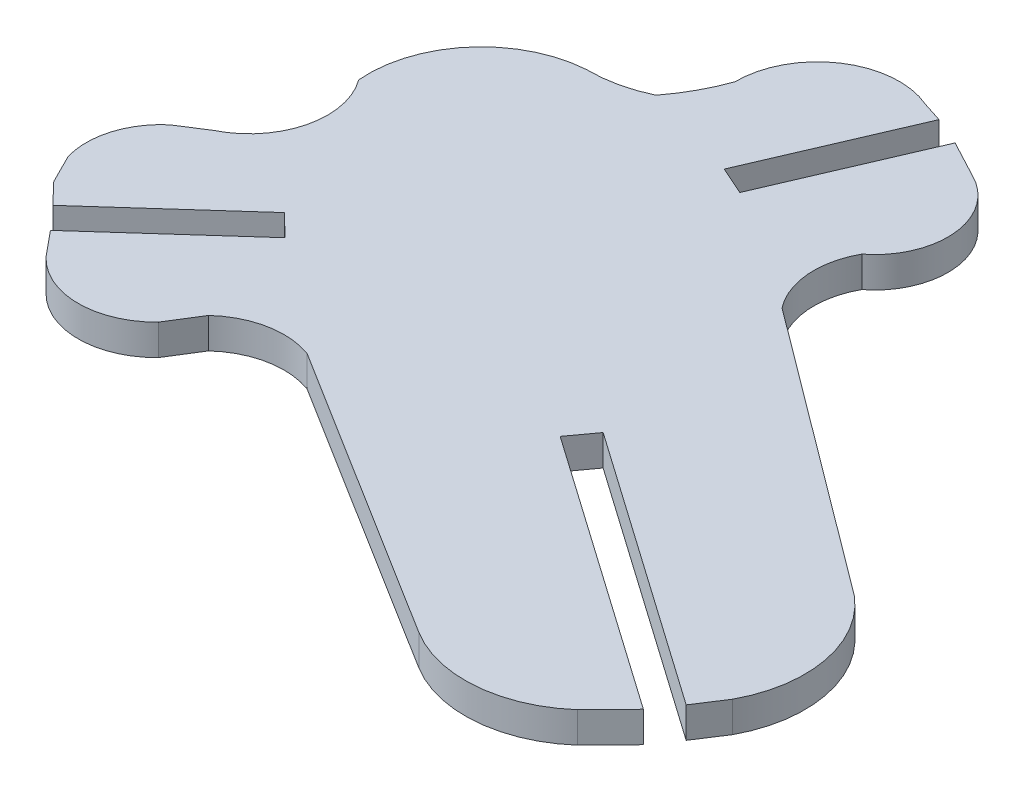
ISO-10303-21;
HEADER;
FILE_DESCRIPTION(('STEP AP214'),'2;1');
FILE_NAME('part.step','',(''),(''),'','','');
FILE_SCHEMA(('AUTOMOTIVE_DESIGN { 1 0 10303 214 1 1 1 1 }'));
ENDSEC;
DATA;
#1=APPLICATION_CONTEXT('core data for automotive mechanical design processes');
#2=APPLICATION_PROTOCOL_DEFINITION('international standard','automotive_design',2000,#1);
#3=PRODUCT_CONTEXT('',#1,'mechanical');
#4=PRODUCT('Part','Part','',(#3));
#5=PRODUCT_RELATED_PRODUCT_CATEGORY('part','',(#4));
#6=PRODUCT_DEFINITION_FORMATION('','',#4);
#7=PRODUCT_DEFINITION_CONTEXT('part definition',#1,'design');
#8=PRODUCT_DEFINITION('design','',#6,#7);
#9=PRODUCT_DEFINITION_SHAPE('','',#8);
#10=(LENGTH_UNIT() NAMED_UNIT(*) SI_UNIT(.MILLI.,.METRE.));
#11=(NAMED_UNIT(*) PLANE_ANGLE_UNIT() SI_UNIT($,.RADIAN.));
#12=(NAMED_UNIT(*) SI_UNIT($,.STERADIAN.) SOLID_ANGLE_UNIT());
#13=UNCERTAINTY_MEASURE_WITH_UNIT(LENGTH_MEASURE(1.E-05),#10,'distance_accuracy_value','');
#14=(GEOMETRIC_REPRESENTATION_CONTEXT(3) GLOBAL_UNCERTAINTY_ASSIGNED_CONTEXT((#13)) GLOBAL_UNIT_ASSIGNED_CONTEXT((#10,
#11,#12)) REPRESENTATION_CONTEXT('',''));
#15=CARTESIAN_POINT('',(0.,0.,0.));
#16=DIRECTION('',(0.,0.,1.));
#17=DIRECTION('',(1.,0.,0.));
#18=AXIS2_PLACEMENT_3D('',#15,#16,#17);
#19=CARTESIAN_POINT('',(-378.561300394113,2.,-476.52606898203));
#20=DIRECTION('',(-0.838786714596922,0.,-0.544460143091945));
#21=DIRECTION('',(-0.544460143091945,0.,0.838786714596922));
#22=AXIS2_PLACEMENT_3D('',#19,#20,#21);
#23=PLANE('',#22);
#24=DIRECTION('',(0.544460143091945,0.,-0.838786714596922));
#25=VECTOR('',#24,1.);
#26=CARTESIAN_POINT('',(-378.561300394113,0.,-476.52606898203));
#27=LINE('',#26,#25);
#28=CARTESIAN_POINT('',(-283.586609999994,0.,-622.842579999972));
#29=VERTEX_POINT('',#28);
#30=CARTESIAN_POINT('',(-282.399079999994,0.,-624.672069999972));
#31=VERTEX_POINT('',#30);
#32=EDGE_CURVE('E11',#29,#31,#27,.T.);
#33=ORIENTED_EDGE('',*,*,#32,.T.);
#34=DIRECTION('',(0.,-1.,0.));
#35=VECTOR('',#34,1.);
#36=CARTESIAN_POINT('',(-282.399079999994,2.,-624.672069999972));
#37=LINE('',#36,#35);
#38=CARTESIAN_POINT('',(-282.399079999994,2.,-624.672069999972));
#39=VERTEX_POINT('',#38);
#40=EDGE_CURVE('E612',#39,#31,#37,.T.);
#41=ORIENTED_EDGE('',*,*,#40,.F.);
#42=DIRECTION('',(0.544460143091945,0.,-0.838786714596922));
#43=VECTOR('',#42,1.);
#44=CARTESIAN_POINT('',(-378.561300394113,2.,-476.52606898203));
#45=LINE('',#44,#43);
#46=CARTESIAN_POINT('',(-283.586609999994,2.,-622.842579999972));
#47=VERTEX_POINT('',#46);
#48=EDGE_CURVE('E41',#47,#39,#45,.T.);
#49=ORIENTED_EDGE('',*,*,#48,.F.);
#50=DIRECTION('',(0.,-1.,0.));
#51=VECTOR('',#50,1.);
#52=CARTESIAN_POINT('',(-283.586609999994,2.,-622.842579999972));
#53=LINE('',#52,#51);
#54=EDGE_CURVE('E285',#47,#29,#53,.T.);
#55=ORIENTED_EDGE('',*,*,#54,.T.);
#56=EDGE_LOOP('',(#33,#41,#49,#55));
#57=FACE_BOUND('',#56,.T.);
#58=ADVANCED_FACE('F37',(#57),#23,.F.);
#59=CARTESIAN_POINT('',(-289.332270328096,2.,-628.422141711353));
#60=DIRECTION('',(0.,-1.,0.));
#61=DIRECTION('',(0.,0.,-1.));
#62=AXIS2_PLACEMENT_3D('',#59,#60,#61);
#63=CYLINDRICAL_SURFACE('',#62,7.88239595340002);
#64=CARTESIAN_POINT('',(-289.332270328096,0.,-628.422141711353));
#65=DIRECTION('',(0.,1.,0.));
#66=DIRECTION('',(0.,0.,1.));
#67=AXIS2_PLACEMENT_3D('',#64,#65,#66);
#68=CIRCLE('',#67,7.88239595340002);
#69=CARTESIAN_POINT('',(-284.277699999916,0.,-634.470570000062));
#70=VERTEX_POINT('',#69);
#71=EDGE_CURVE('E47',#31,#70,#68,.T.);
#72=ORIENTED_EDGE('',*,*,#71,.T.);
#73=DIRECTION('',(0.,-1.,0.));
#74=VECTOR('',#73,1.);
#75=CARTESIAN_POINT('',(-284.277699999916,2.,-634.470570000062));
#76=LINE('',#75,#74);
#77=CARTESIAN_POINT('',(-284.277699999916,2.,-634.470570000062));
#78=VERTEX_POINT('',#77);
#79=EDGE_CURVE('E266',#78,#70,#76,.T.);
#80=ORIENTED_EDGE('',*,*,#79,.F.);
#81=CARTESIAN_POINT('',(-289.332270328096,2.,-628.422141711353));
#82=DIRECTION('',(0.,1.,0.));
#83=DIRECTION('',(0.,0.,1.));
#84=AXIS2_PLACEMENT_3D('',#81,#82,#83);
#85=CIRCLE('',#84,7.88239595340002);
#86=EDGE_CURVE('E155',#39,#78,#85,.T.);
#87=ORIENTED_EDGE('',*,*,#86,.F.);
#88=ORIENTED_EDGE('',*,*,#40,.T.);
#89=EDGE_LOOP('',(#72,#80,#87,#88));
#90=FACE_BOUND('',#89,.T.);
#91=ADVANCED_FACE('F613',(#90),#63,.T.);
#92=CARTESIAN_POINT('',(-409.518925743957,2.,-727.979335949588));
#93=DIRECTION('',(-0.598269996905994,0.,0.801294584283522));
#94=DIRECTION('',(0.801294584283522,0.,0.598269996905994));
#95=AXIS2_PLACEMENT_3D('',#92,#93,#94);
#96=PLANE('',#95);
#97=DIRECTION('',(-0.801294584283522,0.,-0.598269996905994));
#98=VECTOR('',#97,1.);
#99=CARTESIAN_POINT('',(-409.518925743957,0.,-727.979335949588));
#100=LINE('',#99,#98);
#101=CARTESIAN_POINT('',(-302.832329999945,0.,-648.32400000001));
#102=VERTEX_POINT('',#101);
#103=EDGE_CURVE('E269',#70,#102,#100,.T.);
#104=ORIENTED_EDGE('',*,*,#103,.T.);
#105=DIRECTION('',(0.,-1.,0.));
#106=VECTOR('',#105,1.);
#107=CARTESIAN_POINT('',(-302.832329999945,2.,-648.32400000001));
#108=LINE('',#107,#106);
#109=CARTESIAN_POINT('',(-302.832329999945,2.,-648.32400000001));
#110=VERTEX_POINT('',#109);
#111=EDGE_CURVE('E256',#110,#102,#108,.T.);
#112=ORIENTED_EDGE('',*,*,#111,.F.);
#113=DIRECTION('',(-0.801294584283522,0.,-0.598269996905994));
#114=VECTOR('',#113,1.);
#115=CARTESIAN_POINT('',(-409.518925743957,2.,-727.979335949588));
#116=LINE('',#115,#114);
#117=EDGE_CURVE('E344',#78,#110,#116,.T.);
#118=ORIENTED_EDGE('',*,*,#117,.F.);
#119=ORIENTED_EDGE('',*,*,#79,.T.);
#120=EDGE_LOOP('',(#104,#112,#118,#119));
#121=FACE_BOUND('',#120,.T.);
#122=ADVANCED_FACE('F270',(#121),#96,.F.);
#123=CARTESIAN_POINT('',(-298.786970211467,2.,-651.471792718293));
#124=DIRECTION('',(0.,-1.,0.));
#125=DIRECTION('',(0.,0.,-1.));
#126=AXIS2_PLACEMENT_3D('',#123,#124,#125);
#127=CYLINDRICAL_SURFACE('',#126,5.12577163122829);
#128=CARTESIAN_POINT('',(-298.786970211467,0.,-651.471792718293));
#129=DIRECTION('',(0.,1.,0.));
#130=DIRECTION('',(0.,0.,1.));
#131=AXIS2_PLACEMENT_3D('',#128,#129,#130);
#132=CIRCLE('',#131,5.12577163122829);
#133=CARTESIAN_POINT('',(-303.270539999969,0.,-653.955970000039));
#134=VERTEX_POINT('',#133);
#135=EDGE_CURVE('E260',#134,#102,#132,.T.);
#136=ORIENTED_EDGE('',*,*,#135,.F.);
#137=DIRECTION('',(0.,-1.,0.));
#138=VECTOR('',#137,1.);
#139=CARTESIAN_POINT('',(-303.270539999969,2.,-653.955970000039));
#140=LINE('',#139,#138);
#141=CARTESIAN_POINT('',(-303.270539999969,2.,-653.955970000039));
#142=VERTEX_POINT('',#141);
#143=EDGE_CURVE('E265',#142,#134,#140,.T.);
#144=ORIENTED_EDGE('',*,*,#143,.F.);
#145=CARTESIAN_POINT('',(-298.786970211467,2.,-651.471792718293));
#146=DIRECTION('',(0.,1.,0.));
#147=DIRECTION('',(0.,0.,1.));
#148=AXIS2_PLACEMENT_3D('',#145,#146,#147);
#149=CIRCLE('',#148,5.12577163122829);
#150=EDGE_CURVE('E262',#142,#110,#149,.T.);
#151=ORIENTED_EDGE('',*,*,#150,.T.);
#152=ORIENTED_EDGE('',*,*,#111,.T.);
#153=EDGE_LOOP('',(#136,#144,#151,#152));
#154=FACE_BOUND('',#153,.T.);
#155=ADVANCED_FACE('F258',(#154),#127,.F.);
#156=CARTESIAN_POINT('',(-306.168269640505,2.,-657.708026461513));
#157=DIRECTION('',(0.,-1.,0.));
#158=DIRECTION('',(0.,0.,-1.));
#159=AXIS2_PLACEMENT_3D('',#156,#157,#158);
#160=CYLINDRICAL_SURFACE('',#159,4.7407557161);
#161=CARTESIAN_POINT('',(-306.168269640505,0.,-657.708026461513));
#162=DIRECTION('',(0.,1.,0.));
#163=DIRECTION('',(0.,0.,1.));
#164=AXIS2_PLACEMENT_3D('',#161,#162,#163);
#165=CIRCLE('',#164,4.7407557161);
#166=CARTESIAN_POINT('',(-304.08436999999,0.,-661.966210000065));
#167=VERTEX_POINT('',#166);
#168=EDGE_CURVE('E275',#134,#167,#165,.T.);
#169=ORIENTED_EDGE('',*,*,#168,.T.);
#170=DIRECTION('',(0.,-1.,0.));
#171=VECTOR('',#170,1.);
#172=CARTESIAN_POINT('',(-304.08436999999,2.,-661.966210000065));
#173=LINE('',#172,#171);
#174=CARTESIAN_POINT('',(-304.08436999999,2.,-661.966210000065));
#175=VERTEX_POINT('',#174);
#176=EDGE_CURVE('E416',#175,#167,#173,.T.);
#177=ORIENTED_EDGE('',*,*,#176,.F.);
#178=CARTESIAN_POINT('',(-306.168269640505,2.,-657.708026461513));
#179=DIRECTION('',(0.,1.,0.));
#180=DIRECTION('',(0.,0.,1.));
#181=AXIS2_PLACEMENT_3D('',#178,#179,#180);
#182=CIRCLE('',#181,4.7407557161);
#183=EDGE_CURVE('E341',#142,#175,#182,.T.);
#184=ORIENTED_EDGE('',*,*,#183,.F.);
#185=ORIENTED_EDGE('',*,*,#143,.T.);
#186=EDGE_LOOP('',(#169,#177,#184,#185));
#187=FACE_BOUND('',#186,.T.);
#188=ADVANCED_FACE('F607',(#187),#160,.T.);
#189=CARTESIAN_POINT('',(-439.594122259617,2.,-734.137268923904));
#190=DIRECTION('',(-0.470076957730303,0.,0.882625432338669));
#191=DIRECTION('',(0.882625432338669,0.,0.470076957730303));
#192=AXIS2_PLACEMENT_3D('',#189,#190,#191);
#193=PLANE('',#192);
#194=DIRECTION('',(-0.882625432338669,0.,-0.470076957730303));
#195=VECTOR('',#194,1.);
#196=CARTESIAN_POINT('',(-439.594122259617,0.,-734.137268923904));
#197=LINE('',#196,#195);
#198=CARTESIAN_POINT('',(-306.502179999992,0.,-663.253910000007));
#199=VERTEX_POINT('',#198);
#200=EDGE_CURVE('E277',#167,#199,#197,.T.);
#201=ORIENTED_EDGE('',*,*,#200,.T.);
#202=DIRECTION('',(0.,-1.,0.));
#203=VECTOR('',#202,1.);
#204=CARTESIAN_POINT('',(-306.502179999992,2.,-663.253910000007));
#205=LINE('',#204,#203);
#206=CARTESIAN_POINT('',(-306.502179999992,2.,-663.253910000007));
#207=VERTEX_POINT('',#206);
#208=EDGE_CURVE('E413',#207,#199,#205,.T.);
#209=ORIENTED_EDGE('',*,*,#208,.F.);
#210=DIRECTION('',(-0.882625432338669,0.,-0.470076957730303));
#211=VECTOR('',#210,1.);
#212=CARTESIAN_POINT('',(-439.594122259617,2.,-734.137268923904));
#213=LINE('',#212,#211);
#214=EDGE_CURVE('E339',#175,#207,#213,.T.);
#215=ORIENTED_EDGE('',*,*,#214,.F.);
#216=ORIENTED_EDGE('',*,*,#176,.T.);
#217=EDGE_LOOP('',(#201,#209,#215,#216));
#218=FACE_BOUND('',#217,.T.);
#219=ADVANCED_FACE('F411',(#218),#193,.F.);
#220=CARTESIAN_POINT('',(-373.713233914578,2.,-506.785670706769));
#221=DIRECTION('',(0.918818909782736,0.,0.394679377502377));
#222=DIRECTION('',(0.394679377502377,0.,-0.918818909782736));
#223=AXIS2_PLACEMENT_3D('',#220,#221,#222);
#224=PLANE('',#223);
#225=DIRECTION('',(-0.394679377502377,0.,0.918818909782736));
#226=VECTOR('',#225,1.);
#227=CARTESIAN_POINT('',(-373.713233914578,0.,-506.785670706769));
#228=LINE('',#227,#226);
#229=CARTESIAN_POINT('',(-310.710939999992,0.,-653.455860000007));
#230=VERTEX_POINT('',#229);
#231=EDGE_CURVE('E406',#199,#230,#228,.T.);
#232=ORIENTED_EDGE('',*,*,#231,.T.);
#233=DIRECTION('',(0.,-1.,0.));
#234=VECTOR('',#233,1.);
#235=CARTESIAN_POINT('',(-310.710939999992,2.,-653.455860000007));
#236=LINE('',#235,#234);
#237=CARTESIAN_POINT('',(-310.710939999992,2.,-653.455860000007));
#238=VERTEX_POINT('',#237);
#239=EDGE_CURVE('E422',#238,#230,#236,.T.);
#240=ORIENTED_EDGE('',*,*,#239,.F.);
#241=DIRECTION('',(-0.394679377502377,0.,0.918818909782736));
#242=VECTOR('',#241,1.);
#243=CARTESIAN_POINT('',(-373.713233914578,2.,-506.785670706769));
#244=LINE('',#243,#242);
#245=EDGE_CURVE('E337',#207,#238,#244,.T.);
#246=ORIENTED_EDGE('',*,*,#245,.F.);
#247=ORIENTED_EDGE('',*,*,#208,.T.);
#248=EDGE_LOOP('',(#232,#240,#246,#247));
#249=FACE_BOUND('',#248,.T.);
#250=ADVANCED_FACE('F419',(#249),#224,.F.);
#251=CARTESIAN_POINT('',(-460.12903676952,2.,-719.925042014085));
#252=DIRECTION('',(-0.40645063244985,0.,0.913672744138248));
#253=DIRECTION('',(0.913672744138248,0.,0.40645063244985));
#254=AXIS2_PLACEMENT_3D('',#251,#252,#253);
#255=PLANE('',#254);
#256=DIRECTION('',(-0.913672744138248,0.,-0.40645063244985));
#257=VECTOR('',#256,1.);
#258=CARTESIAN_POINT('',(-460.12903676952,0.,-719.925042014085));
#259=LINE('',#258,#257);
#260=CARTESIAN_POINT('',(-312.538439999992,0.,-654.268830000007));
#261=VERTEX_POINT('',#260);
#262=EDGE_CURVE('E404',#230,#261,#259,.T.);
#263=ORIENTED_EDGE('',*,*,#262,.T.);
#264=DIRECTION('',(0.,-1.,0.));
#265=VECTOR('',#264,1.);
#266=CARTESIAN_POINT('',(-312.538439999992,2.,-654.268830000007));
#267=LINE('',#266,#265);
#268=CARTESIAN_POINT('',(-312.538439999992,2.,-654.268830000007));
#269=VERTEX_POINT('',#268);
#270=EDGE_CURVE('E432',#269,#261,#267,.T.);
#271=ORIENTED_EDGE('',*,*,#270,.F.);
#272=DIRECTION('',(-0.913672744138248,0.,-0.40645063244985));
#273=VECTOR('',#272,1.);
#274=CARTESIAN_POINT('',(-460.12903676952,2.,-719.925042014085));
#275=LINE('',#274,#273);
#276=EDGE_CURVE('E335',#238,#269,#275,.T.);
#277=ORIENTED_EDGE('',*,*,#276,.F.);
#278=ORIENTED_EDGE('',*,*,#239,.T.);
#279=EDGE_LOOP('',(#263,#271,#277,#278));
#280=FACE_BOUND('',#279,.T.);
#281=ADVANCED_FACE('F430',(#280),#255,.F.);
#282=CARTESIAN_POINT('',(-375.550906364474,2.,-507.57501828767));
#283=DIRECTION('',(-0.918818852040724,0.,-0.394679511926534));
#284=DIRECTION('',(-0.394679511926534,0.,0.918818852040724));
#285=AXIS2_PLACEMENT_3D('',#282,#283,#284);
#286=PLANE('',#285);
#287=DIRECTION('',(0.394679511926534,0.,-0.918818852040724));
#288=VECTOR('',#287,1.);
#289=CARTESIAN_POINT('',(-375.550906364474,0.,-507.57501828767));
#290=LINE('',#289,#288);
#291=CARTESIAN_POINT('',(-308.339819999992,0.,-664.043270000007));
#292=VERTEX_POINT('',#291);
#293=EDGE_CURVE('E402',#261,#292,#290,.T.);
#294=ORIENTED_EDGE('',*,*,#293,.T.);
#295=DIRECTION('',(0.,-1.,0.));
#296=VECTOR('',#295,1.);
#297=CARTESIAN_POINT('',(-308.339819999992,2.,-664.043270000007));
#298=LINE('',#297,#296);
#299=CARTESIAN_POINT('',(-308.339819999992,2.,-664.043270000007));
#300=VERTEX_POINT('',#299);
#301=EDGE_CURVE('E438',#300,#292,#298,.T.);
#302=ORIENTED_EDGE('',*,*,#301,.F.);
#303=DIRECTION('',(0.394679511926534,0.,-0.918818852040724));
#304=VECTOR('',#303,1.);
#305=CARTESIAN_POINT('',(-375.550906364474,2.,-507.57501828767));
#306=LINE('',#305,#304);
#307=EDGE_CURVE('E333',#269,#300,#306,.T.);
#308=ORIENTED_EDGE('',*,*,#307,.F.);
#309=ORIENTED_EDGE('',*,*,#270,.T.);
#310=EDGE_LOOP('',(#294,#302,#308,#309));
#311=FACE_BOUND('',#310,.T.);
#312=ADVANCED_FACE('F435',(#311),#286,.F.);
#313=CARTESIAN_POINT('',(-478.407131348155,2.,-719.005644871996));
#314=DIRECTION('',(-0.307519401026566,0.,0.951541810953288));
#315=DIRECTION('',(0.951541810953288,0.,0.307519401026566));
#316=AXIS2_PLACEMENT_3D('',#313,#314,#315);
#317=PLANE('',#316);
#318=DIRECTION('',(-0.951541810953288,0.,-0.307519401026566));
#319=VECTOR('',#318,1.);
#320=CARTESIAN_POINT('',(-478.407131348155,0.,-719.005644871996));
#321=LINE('',#320,#319);
#322=CARTESIAN_POINT('',(-309.657629999992,0.,-664.469160000007));
#323=VERTEX_POINT('',#322);
#324=EDGE_CURVE('E400',#292,#323,#321,.T.);
#325=ORIENTED_EDGE('',*,*,#324,.T.);
#326=DIRECTION('',(0.,-1.,0.));
#327=VECTOR('',#326,1.);
#328=CARTESIAN_POINT('',(-309.657629999992,2.,-664.469160000007));
#329=LINE('',#328,#327);
#330=CARTESIAN_POINT('',(-309.657629999992,2.,-664.469160000007));
#331=VERTEX_POINT('',#330);
#332=EDGE_CURVE('E440',#331,#323,#329,.T.);
#333=ORIENTED_EDGE('',*,*,#332,.F.);
#334=DIRECTION('',(-0.951541810953288,0.,-0.307519401026566));
#335=VECTOR('',#334,1.);
#336=CARTESIAN_POINT('',(-478.407131348155,2.,-719.005644871996));
#337=LINE('',#336,#335);
#338=EDGE_CURVE('E331',#300,#331,#337,.T.);
#339=ORIENTED_EDGE('',*,*,#338,.F.);
#340=ORIENTED_EDGE('',*,*,#301,.T.);
#341=EDGE_LOOP('',(#325,#333,#339,#340));
#342=FACE_BOUND('',#341,.T.);
#343=ADVANCED_FACE('F604',(#342),#317,.F.);
#344=CARTESIAN_POINT('',(-311.779982562592,2.,-659.580154934089));
#345=DIRECTION('',(0.,-1.,0.));
#346=DIRECTION('',(0.,0.,-1.));
#347=AXIS2_PLACEMENT_3D('',#344,#345,#346);
#348=CYLINDRICAL_SURFACE('',#347,5.32979839530001);
#349=CARTESIAN_POINT('',(-311.779982562592,0.,-659.580154934089));
#350=DIRECTION('',(0.,1.,0.));
#351=DIRECTION('',(0.,0.,1.));
#352=AXIS2_PLACEMENT_3D('',#349,#350,#351);
#353=CIRCLE('',#352,5.32979839530001);
#354=CARTESIAN_POINT('',(-317.109500000046,0.,-659.525429999971));
#355=VERTEX_POINT('',#354);
#356=EDGE_CURVE('E397',#323,#355,#353,.T.);
#357=ORIENTED_EDGE('',*,*,#356,.T.);
#358=DIRECTION('',(0.,-1.,0.));
#359=VECTOR('',#358,1.);
#360=CARTESIAN_POINT('',(-317.109500000046,2.,-659.525429999971));
#361=LINE('',#360,#359);
#362=CARTESIAN_POINT('',(-317.109500000046,2.,-659.525429999971));
#363=VERTEX_POINT('',#362);
#364=EDGE_CURVE('E446',#363,#355,#361,.T.);
#365=ORIENTED_EDGE('',*,*,#364,.F.);
#366=CARTESIAN_POINT('',(-311.779982562592,2.,-659.580154934089));
#367=DIRECTION('',(0.,1.,0.));
#368=DIRECTION('',(0.,0.,1.));
#369=AXIS2_PLACEMENT_3D('',#366,#367,#368);
#370=CIRCLE('',#369,5.32979839530001);
#371=EDGE_CURVE('E329',#331,#363,#370,.T.);
#372=ORIENTED_EDGE('',*,*,#371,.F.);
#373=ORIENTED_EDGE('',*,*,#332,.T.);
#374=EDGE_LOOP('',(#357,#365,#372,#373));
#375=FACE_BOUND('',#374,.T.);
#376=ADVANCED_FACE('F599',(#375),#348,.T.);
#377=CARTESIAN_POINT('',(-328.488875009774,2.,-663.600909113507));
#378=DIRECTION('',(0.,-1.,0.));
#379=DIRECTION('',(0.,0.,-1.));
#380=AXIS2_PLACEMENT_3D('',#377,#378,#379);
#381=CYLINDRICAL_SURFACE('',#380,12.087171117217);
#382=CARTESIAN_POINT('',(-328.488875009774,0.,-663.600909113507));
#383=DIRECTION('',(0.,1.,0.));
#384=DIRECTION('',(0.,0.,1.));
#385=AXIS2_PLACEMENT_3D('',#382,#383,#384);
#386=CIRCLE('',#385,12.087171117217);
#387=CARTESIAN_POINT('',(-318.925520000014,0.,-656.208890000018));
#388=VERTEX_POINT('',#387);
#389=EDGE_CURVE('E394',#388,#355,#386,.T.);
#390=ORIENTED_EDGE('',*,*,#389,.F.);
#391=DIRECTION('',(0.,-1.,0.));
#392=VECTOR('',#391,1.);
#393=CARTESIAN_POINT('',(-318.925520000014,2.,-656.208890000018));
#394=LINE('',#393,#392);
#395=CARTESIAN_POINT('',(-318.925520000014,2.,-656.208890000018));
#396=VERTEX_POINT('',#395);
#397=EDGE_CURVE('E448',#396,#388,#394,.T.);
#398=ORIENTED_EDGE('',*,*,#397,.F.);
#399=CARTESIAN_POINT('',(-328.488875009774,2.,-663.600909113507));
#400=DIRECTION('',(0.,1.,0.));
#401=DIRECTION('',(0.,0.,1.));
#402=AXIS2_PLACEMENT_3D('',#399,#400,#401);
#403=CIRCLE('',#402,12.087171117217);
#404=EDGE_CURVE('E326',#396,#363,#403,.T.);
#405=ORIENTED_EDGE('',*,*,#404,.T.);
#406=ORIENTED_EDGE('',*,*,#364,.T.);
#407=EDGE_LOOP('',(#390,#398,#405,#406));
#408=FACE_BOUND('',#407,.T.);
#409=ADVANCED_FACE('F595',(#408),#381,.F.);
#410=CARTESIAN_POINT('',(-322.523782856363,2.,-663.753401573091));
#411=DIRECTION('',(0.,-1.,0.));
#412=DIRECTION('',(0.,0.,-1.));
#413=AXIS2_PLACEMENT_3D('',#410,#411,#412);
#414=CYLINDRICAL_SURFACE('',#413,8.35865721629991);
#415=CARTESIAN_POINT('',(-322.523782856363,0.,-663.753401573091));
#416=DIRECTION('',(0.,1.,0.));
#417=DIRECTION('',(0.,0.,1.));
#418=AXIS2_PLACEMENT_3D('',#415,#416,#417);
#419=CIRCLE('',#418,8.35865721629991);
#420=CARTESIAN_POINT('',(-322.620160000015,0.,-655.395300000019));
#421=VERTEX_POINT('',#420);
#422=EDGE_CURVE('E391',#421,#388,#419,.T.);
#423=ORIENTED_EDGE('',*,*,#422,.F.);
#424=DIRECTION('',(0.,-1.,0.));
#425=VECTOR('',#424,1.);
#426=CARTESIAN_POINT('',(-322.620160000015,2.,-655.395300000019));
#427=LINE('',#426,#425);
#428=CARTESIAN_POINT('',(-322.620160000015,2.,-655.395300000019));
#429=VERTEX_POINT('',#428);
#430=EDGE_CURVE('E450',#429,#421,#427,.T.);
#431=ORIENTED_EDGE('',*,*,#430,.F.);
#432=CARTESIAN_POINT('',(-322.523782856363,2.,-663.753401573091));
#433=DIRECTION('',(0.,1.,0.));
#434=DIRECTION('',(0.,0.,1.));
#435=AXIS2_PLACEMENT_3D('',#432,#433,#434);
#436=CIRCLE('',#435,8.35865721629991);
#437=EDGE_CURVE('E323',#429,#396,#436,.T.);
#438=ORIENTED_EDGE('',*,*,#437,.T.);
#439=ORIENTED_EDGE('',*,*,#397,.T.);
#440=EDGE_LOOP('',(#423,#431,#438,#439));
#441=FACE_BOUND('',#440,.T.);
#442=ADVANCED_FACE('F590',(#441),#414,.F.);
#443=CARTESIAN_POINT('',(-322.127727335265,2.,-648.055033113613));
#444=DIRECTION('',(0.,-1.,0.));
#445=DIRECTION('',(0.,0.,-1.));
#446=AXIS2_PLACEMENT_3D('',#443,#444,#445);
#447=CYLINDRICAL_SURFACE('',#446,7.35676613009999);
#448=CARTESIAN_POINT('',(-322.127727335265,0.,-648.055033113613));
#449=DIRECTION('',(0.,1.,0.));
#450=DIRECTION('',(0.,0.,1.));
#451=AXIS2_PLACEMENT_3D('',#448,#449,#450);
#452=CIRCLE('',#451,7.35676613009999);
#453=CARTESIAN_POINT('',(-329.455989999994,0.,-647.408060000012));
#454=VERTEX_POINT('',#453);
#455=EDGE_CURVE('E388',#421,#454,#452,.T.);
#456=ORIENTED_EDGE('',*,*,#455,.T.);
#457=DIRECTION('',(0.,-1.,0.));
#458=VECTOR('',#457,1.);
#459=CARTESIAN_POINT('',(-329.455989999994,2.,-647.408060000012));
#460=LINE('',#459,#458);
#461=CARTESIAN_POINT('',(-329.455989999994,2.,-647.408060000012));
#462=VERTEX_POINT('',#461);
#463=EDGE_CURVE('E452',#462,#454,#460,.T.);
#464=ORIENTED_EDGE('',*,*,#463,.F.);
#465=CARTESIAN_POINT('',(-322.127727335265,2.,-648.055033113613));
#466=DIRECTION('',(0.,1.,0.));
#467=DIRECTION('',(0.,0.,1.));
#468=AXIS2_PLACEMENT_3D('',#465,#466,#467);
#469=CIRCLE('',#468,7.35676613009999);
#470=EDGE_CURVE('E321',#429,#462,#469,.T.);
#471=ORIENTED_EDGE('',*,*,#470,.F.);
#472=ORIENTED_EDGE('',*,*,#430,.T.);
#473=EDGE_LOOP('',(#456,#464,#471,#472));
#474=FACE_BOUND('',#473,.T.);
#475=ADVANCED_FACE('F587',(#474),#447,.T.);
#476=CARTESIAN_POINT('',(-333.562859437887,2.,-644.407922265373));
#477=DIRECTION('',(0.,-1.,0.));
#478=DIRECTION('',(0.,0.,-1.));
#479=AXIS2_PLACEMENT_3D('',#476,#477,#478);
#480=CYLINDRICAL_SURFACE('',#479,5.08598102697017);
#481=CARTESIAN_POINT('',(-333.562859437887,0.,-644.407922265373));
#482=DIRECTION('',(0.,1.,0.));
#483=DIRECTION('',(0.,0.,1.));
#484=AXIS2_PLACEMENT_3D('',#481,#482,#483);
#485=CIRCLE('',#484,5.08598102697017);
#486=CARTESIAN_POINT('',(-331.334609999945,0.,-639.836039999937));
#487=VERTEX_POINT('',#486);
#488=EDGE_CURVE('E385',#487,#454,#485,.T.);
#489=ORIENTED_EDGE('',*,*,#488,.F.);
#490=DIRECTION('',(0.,-1.,0.));
#491=VECTOR('',#490,1.);
#492=CARTESIAN_POINT('',(-331.334609999945,2.,-639.836039999937));
#493=LINE('',#492,#491);
#494=CARTESIAN_POINT('',(-331.334609999945,2.,-639.836039999937));
#495=VERTEX_POINT('',#494);
#496=EDGE_CURVE('E454',#495,#487,#493,.T.);
#497=ORIENTED_EDGE('',*,*,#496,.F.);
#498=CARTESIAN_POINT('',(-333.562859437887,2.,-644.407922265373));
#499=DIRECTION('',(0.,1.,0.));
#500=DIRECTION('',(0.,0.,1.));
#501=AXIS2_PLACEMENT_3D('',#498,#499,#500);
#502=CIRCLE('',#501,5.08598102697017);
#503=EDGE_CURVE('E318',#495,#462,#502,.T.);
#504=ORIENTED_EDGE('',*,*,#503,.T.);
#505=ORIENTED_EDGE('',*,*,#463,.T.);
#506=EDGE_LOOP('',(#489,#497,#504,#505));
#507=FACE_BOUND('',#506,.T.);
#508=ADVANCED_FACE('F581',(#507),#480,.F.);
#509=CARTESIAN_POINT('',(-499.819022865597,2.,-531.594983030916));
#510=DIRECTION('',(0.540508991620321,0.,0.841338237558227));
#511=DIRECTION('',(0.841338237558227,0.,-0.540508991620321));
#512=AXIS2_PLACEMENT_3D('',#509,#510,#511);
#513=PLANE('',#512);
#514=DIRECTION('',(-0.841338237558227,0.,0.540508991620321));
#515=VECTOR('',#514,1.);
#516=CARTESIAN_POINT('',(-499.819022865597,0.,-531.594983030916));
#517=LINE('',#516,#515);
#518=CARTESIAN_POINT('',(-333.08802,0.,-638.70958));
#519=VERTEX_POINT('',#518);
#520=EDGE_CURVE('E383',#487,#519,#517,.T.);
#521=ORIENTED_EDGE('',*,*,#520,.T.);
#522=DIRECTION('',(0.,-1.,0.));
#523=VECTOR('',#522,1.);
#524=CARTESIAN_POINT('',(-333.08802,2.,-638.70958));
#525=LINE('',#524,#523);
#526=CARTESIAN_POINT('',(-333.08802,2.,-638.70958));
#527=VERTEX_POINT('',#526);
#528=EDGE_CURVE('E456',#527,#519,#525,.T.);
#529=ORIENTED_EDGE('',*,*,#528,.F.);
#530=DIRECTION('',(-0.841338237558227,0.,0.540508991620321));
#531=VECTOR('',#530,1.);
#532=CARTESIAN_POINT('',(-499.819022865597,2.,-531.594983030916));
#533=LINE('',#532,#531);
#534=EDGE_CURVE('E316',#495,#527,#533,.T.);
#535=ORIENTED_EDGE('',*,*,#534,.F.);
#536=ORIENTED_EDGE('',*,*,#496,.T.);
#537=EDGE_LOOP('',(#521,#529,#535,#536));
#538=FACE_BOUND('',#537,.T.);
#539=ADVANCED_FACE('F647',(#538),#513,.F.);
#540=CARTESIAN_POINT('',(-329.901689448687,2.,-635.007541859157));
#541=DIRECTION('',(0.,-1.,0.));
#542=DIRECTION('',(0.,0.,-1.));
#543=AXIS2_PLACEMENT_3D('',#540,#541,#542);
#544=CYLINDRICAL_SURFACE('',#543,4.88444354849999);
#545=CARTESIAN_POINT('',(-329.901689448687,0.,-635.007541859157));
#546=DIRECTION('',(0.,1.,0.));
#547=DIRECTION('',(0.,0.,1.));
#548=AXIS2_PLACEMENT_3D('',#545,#546,#547);
#549=CIRCLE('',#548,4.88444354849999);
#550=CARTESIAN_POINT('',(-334.591030000044,0.,-633.640839999977));
#551=VERTEX_POINT('',#550);
#552=EDGE_CURVE('E381',#519,#551,#549,.T.);
#553=ORIENTED_EDGE('',*,*,#552,.T.);
#554=DIRECTION('',(0.,-1.,0.));
#555=VECTOR('',#554,1.);
#556=CARTESIAN_POINT('',(-334.591030000044,2.,-633.640839999977));
#557=LINE('',#556,#555);
#558=CARTESIAN_POINT('',(-334.591030000044,2.,-633.640839999977));
#559=VERTEX_POINT('',#558);
#560=EDGE_CURVE('E459',#559,#551,#557,.T.);
#561=ORIENTED_EDGE('',*,*,#560,.F.);
#562=CARTESIAN_POINT('',(-329.901689448687,2.,-635.007541859157));
#563=DIRECTION('',(0.,1.,0.));
#564=DIRECTION('',(0.,0.,1.));
#565=AXIS2_PLACEMENT_3D('',#562,#563,#564);
#566=CIRCLE('',#565,4.88444354849999);
#567=EDGE_CURVE('E314',#527,#559,#566,.T.);
#568=ORIENTED_EDGE('',*,*,#567,.F.);
#569=ORIENTED_EDGE('',*,*,#528,.T.);
#570=EDGE_LOOP('',(#553,#561,#568,#569));
#571=FACE_BOUND('',#570,.T.);
#572=ADVANCED_FACE('F574',(#571),#544,.T.);
#573=CARTESIAN_POINT('',(-348.288606946413,2.,-661.012231345282));
#574=DIRECTION('',(0.894271864181486,0.,-0.447524114359629));
#575=DIRECTION('',(-0.447524114359629,0.,-0.894271864181486));
#576=AXIS2_PLACEMENT_3D('',#573,#574,#575);
#577=PLANE('',#576);
#578=DIRECTION('',(0.447524114359629,0.,0.894271864181486));
#579=VECTOR('',#578,1.);
#580=CARTESIAN_POINT('',(-348.288606946413,0.,-661.012231345282));
#581=LINE('',#580,#579);
#582=CARTESIAN_POINT('',(-333.65144,0.,-631.76329));
#583=VERTEX_POINT('',#582);
#584=EDGE_CURVE('E379',#551,#583,#581,.T.);
#585=ORIENTED_EDGE('',*,*,#584,.T.);
#586=DIRECTION('',(0.,-1.,0.));
#587=VECTOR('',#586,1.);
#588=CARTESIAN_POINT('',(-333.65144,2.,-631.76329));
#589=LINE('',#588,#587);
#590=CARTESIAN_POINT('',(-333.65144,2.,-631.76329));
#591=VERTEX_POINT('',#590);
#592=EDGE_CURVE('E462',#591,#583,#589,.T.);
#593=ORIENTED_EDGE('',*,*,#592,.F.);
#594=DIRECTION('',(0.447524114359629,0.,0.894271864181486));
#595=VECTOR('',#594,1.);
#596=CARTESIAN_POINT('',(-348.288606946413,2.,-661.012231345282));
#597=LINE('',#596,#595);
#598=EDGE_CURVE('E312',#559,#591,#597,.T.);
#599=ORIENTED_EDGE('',*,*,#598,.F.);
#600=ORIENTED_EDGE('',*,*,#560,.T.);
#601=EDGE_LOOP('',(#585,#593,#599,#600));
#602=FACE_BOUND('',#601,.T.);
#603=ADVANCED_FACE('F570',(#602),#577,.F.);
#604=CARTESIAN_POINT('',(-395.544669713122,2.,-696.583930829051));
#605=DIRECTION('',(0.723249754292387,0.,-0.690586557149791));
#606=DIRECTION('',(-0.690586557149791,0.,-0.723249754292387));
#607=AXIS2_PLACEMENT_3D('',#604,#605,#606);
#608=PLANE('',#607);
#609=DIRECTION('',(0.690586557149791,0.,0.723249754292387));
#610=VECTOR('',#609,1.);
#611=CARTESIAN_POINT('',(-395.544669713122,0.,-696.583930829051));
#612=LINE('',#611,#610);
#613=CARTESIAN_POINT('',(-332.33679,0.,-630.38646));
#614=VERTEX_POINT('',#613);
#615=EDGE_CURVE('E377',#583,#614,#612,.T.);
#616=ORIENTED_EDGE('',*,*,#615,.T.);
#617=DIRECTION('',(0.,-1.,0.));
#618=VECTOR('',#617,1.);
#619=CARTESIAN_POINT('',(-332.33679,2.,-630.38646));
#620=LINE('',#619,#618);
#621=CARTESIAN_POINT('',(-332.33679,2.,-630.38646));
#622=VERTEX_POINT('',#621);
#623=EDGE_CURVE('E465',#622,#614,#620,.T.);
#624=ORIENTED_EDGE('',*,*,#623,.F.);
#625=DIRECTION('',(0.690586557149791,0.,0.723249754292387));
#626=VECTOR('',#625,1.);
#627=CARTESIAN_POINT('',(-395.544669713122,2.,-696.583930829051));
#628=LINE('',#627,#626);
#629=EDGE_CURVE('E310',#591,#622,#628,.T.);
#630=ORIENTED_EDGE('',*,*,#629,.F.);
#631=ORIENTED_EDGE('',*,*,#592,.T.);
#632=EDGE_LOOP('',(#616,#624,#630,#631));
#633=FACE_BOUND('',#632,.T.);
#634=ADVANCED_FACE('F565',(#633),#608,.F.);
#635=CARTESIAN_POINT('',(-468.528988811115,2.,-508.220452794344));
#636=DIRECTION('',(-0.667734852766317,0.,-0.744399198280832));
#637=DIRECTION('',(-0.744399198280832,0.,0.667734852766317));
#638=AXIS2_PLACEMENT_3D('',#635,#636,#637);
#639=PLANE('',#638);
#640=DIRECTION('',(0.744399198280832,0.,-0.667734852766317));
#641=VECTOR('',#640,1.);
#642=CARTESIAN_POINT('',(-468.528988811115,0.,-508.220452794344));
#643=LINE('',#642,#641);
#644=CARTESIAN_POINT('',(-324.38355,0.,-637.52061));
#645=VERTEX_POINT('',#644);
#646=EDGE_CURVE('E375',#614,#645,#643,.T.);
#647=ORIENTED_EDGE('',*,*,#646,.T.);
#648=DIRECTION('',(0.,-1.,0.));
#649=VECTOR('',#648,1.);
#650=CARTESIAN_POINT('',(-324.38355,2.,-637.52061));
#651=LINE('',#650,#649);
#652=CARTESIAN_POINT('',(-324.38355,2.,-637.52061));
#653=VERTEX_POINT('',#652);
#654=EDGE_CURVE('E468',#653,#645,#651,.T.);
#655=ORIENTED_EDGE('',*,*,#654,.F.);
#656=DIRECTION('',(0.744399198280832,0.,-0.667734852766317));
#657=VECTOR('',#656,1.);
#658=CARTESIAN_POINT('',(-468.528988811115,2.,-508.220452794344));
#659=LINE('',#658,#657);
#660=EDGE_CURVE('E308',#622,#653,#659,.T.);
#661=ORIENTED_EDGE('',*,*,#660,.F.);
#662=ORIENTED_EDGE('',*,*,#623,.T.);
#663=EDGE_LOOP('',(#647,#655,#661,#662));
#664=FACE_BOUND('',#663,.T.);
#665=ADVANCED_FACE('F559',(#664),#639,.F.);
#666=CARTESIAN_POINT('',(-392.662040374712,2.,-705.647900078666));
#667=DIRECTION('',(0.706322547967826,0.,-0.70789014559622));
#668=DIRECTION('',(-0.70789014559622,0.,-0.706322547967826));
#669=AXIS2_PLACEMENT_3D('',#666,#667,#668);
#670=PLANE('',#669);
#671=DIRECTION('',(0.70789014559622,0.,0.706322547967826));
#672=VECTOR('',#671,1.);
#673=CARTESIAN_POINT('',(-392.662040374712,0.,-705.647900078666));
#674=LINE('',#673,#672);
#675=CARTESIAN_POINT('',(-322.9656,0.,-636.1058));
#676=VERTEX_POINT('',#675);
#677=EDGE_CURVE('E373',#645,#676,#674,.T.);
#678=ORIENTED_EDGE('',*,*,#677,.T.);
#679=DIRECTION('',(0.,-1.,0.));
#680=VECTOR('',#679,1.);
#681=CARTESIAN_POINT('',(-322.9656,2.,-636.1058));
#682=LINE('',#681,#680);
#683=CARTESIAN_POINT('',(-322.9656,2.,-636.1058));
#684=VERTEX_POINT('',#683);
#685=EDGE_CURVE('E471',#684,#676,#682,.T.);
#686=ORIENTED_EDGE('',*,*,#685,.F.);
#687=DIRECTION('',(0.70789014559622,0.,0.706322547967826));
#688=VECTOR('',#687,1.);
#689=CARTESIAN_POINT('',(-392.662040374712,2.,-705.647900078666));
#690=LINE('',#689,#688);
#691=EDGE_CURVE('E306',#653,#684,#690,.T.);
#692=ORIENTED_EDGE('',*,*,#691,.F.);
#693=ORIENTED_EDGE('',*,*,#654,.T.);
#694=EDGE_LOOP('',(#678,#686,#692,#693));
#695=FACE_BOUND('',#694,.T.);
#696=ADVANCED_FACE('F555',(#695),#670,.F.);
#697=CARTESIAN_POINT('',(-467.193580870581,2.,-506.731682398677));
#698=DIRECTION('',(0.667734621664673,0.,0.744399405581665));
#699=DIRECTION('',(0.744399405581665,0.,-0.667734621664673));
#700=AXIS2_PLACEMENT_3D('',#697,#698,#699);
#701=PLANE('',#700);
#702=DIRECTION('',(-0.744399405581665,0.,0.667734621664673));
#703=VECTOR('',#702,1.);
#704=CARTESIAN_POINT('',(-467.193580870581,0.,-506.731682398677));
#705=LINE('',#704,#703);
#706=CARTESIAN_POINT('',(-331.00133,0.,-628.89766));
#707=VERTEX_POINT('',#706);
#708=EDGE_CURVE('E371',#676,#707,#705,.T.);
#709=ORIENTED_EDGE('',*,*,#708,.T.);
#710=DIRECTION('',(0.,-1.,0.));
#711=VECTOR('',#710,1.);
#712=CARTESIAN_POINT('',(-331.00133,2.,-628.89766));
#713=LINE('',#712,#711);
#714=CARTESIAN_POINT('',(-331.00133,2.,-628.89766));
#715=VERTEX_POINT('',#714);
#716=EDGE_CURVE('E474',#715,#707,#713,.T.);
#717=ORIENTED_EDGE('',*,*,#716,.F.);
#718=DIRECTION('',(-0.744399405581665,0.,0.667734621664673));
#719=VECTOR('',#718,1.);
#720=CARTESIAN_POINT('',(-467.193580870581,2.,-506.731682398677));
#721=LINE('',#720,#719);
#722=EDGE_CURVE('E304',#684,#715,#721,.T.);
#723=ORIENTED_EDGE('',*,*,#722,.F.);
#724=ORIENTED_EDGE('',*,*,#685,.T.);
#725=EDGE_LOOP('',(#709,#717,#723,#724));
#726=FACE_BOUND('',#725,.T.);
#727=ADVANCED_FACE('F550',(#726),#701,.F.);
#728=CARTESIAN_POINT('',(-381.918370349119,2.,-690.714273993207));
#729=DIRECTION('',(0.771873611768258,0.,-0.635776004152268));
#730=DIRECTION('',(-0.635776004152268,0.,-0.771873611768258));
#731=AXIS2_PLACEMENT_3D('',#728,#729,#730);
#732=PLANE('',#731);
#733=DIRECTION('',(0.635776004152268,0.,0.771873611768258));
#734=VECTOR('',#733,1.);
#735=CARTESIAN_POINT('',(-381.918370349119,0.,-690.714273993207));
#736=LINE('',#735,#734);
#737=CARTESIAN_POINT('',(-329.64324,0.,-627.24885));
#738=VERTEX_POINT('',#737);
#739=EDGE_CURVE('E369',#707,#738,#736,.T.);
#740=ORIENTED_EDGE('',*,*,#739,.T.);
#741=DIRECTION('',(0.,-1.,0.));
#742=VECTOR('',#741,1.);
#743=CARTESIAN_POINT('',(-329.64324,2.,-627.24885));
#744=LINE('',#743,#742);
#745=CARTESIAN_POINT('',(-329.64324,2.,-627.24885));
#746=VERTEX_POINT('',#745);
#747=EDGE_CURVE('E477',#746,#738,#744,.T.);
#748=ORIENTED_EDGE('',*,*,#747,.F.);
#749=DIRECTION('',(0.635776004152268,0.,0.771873611768258));
#750=VECTOR('',#749,1.);
#751=CARTESIAN_POINT('',(-381.918370349119,2.,-690.714273993207));
#752=LINE('',#751,#750);
#753=EDGE_CURVE('E302',#715,#746,#752,.T.);
#754=ORIENTED_EDGE('',*,*,#753,.F.);
#755=ORIENTED_EDGE('',*,*,#716,.T.);
#756=EDGE_LOOP('',(#740,#748,#754,#755));
#757=FACE_BOUND('',#756,.T.);
#758=ADVANCED_FACE('F544',(#757),#732,.F.);
#759=CARTESIAN_POINT('',(-325.979904999992,2.,-630.747100000008));
#760=DIRECTION('',(0.,-1.,0.));
#761=DIRECTION('',(0.,0.,-1.));
#762=AXIS2_PLACEMENT_3D('',#759,#760,#761);
#763=CYLINDRICAL_SURFACE('',#762,5.06535056879994);
#764=CARTESIAN_POINT('',(-325.979904999992,0.,-630.747100000008));
#765=DIRECTION('',(0.,1.,0.));
#766=DIRECTION('',(0.,0.,1.));
#767=AXIS2_PLACEMENT_3D('',#764,#765,#766);
#768=CIRCLE('',#767,5.06535056879994);
#769=CARTESIAN_POINT('',(-322.316569999993,0.,-627.248849999991));
#770=VERTEX_POINT('',#769);
#771=EDGE_CURVE('E367',#738,#770,#768,.T.);
#772=ORIENTED_EDGE('',*,*,#771,.T.);
#773=DIRECTION('',(0.,-1.,0.));
#774=VECTOR('',#773,1.);
#775=CARTESIAN_POINT('',(-322.316569999993,2.,-627.248849999991));
#776=LINE('',#775,#774);
#777=CARTESIAN_POINT('',(-322.316569999993,2.,-627.248849999991));
#778=VERTEX_POINT('',#777);
#779=EDGE_CURVE('E480',#778,#770,#776,.T.);
#780=ORIENTED_EDGE('',*,*,#779,.F.);
#781=CARTESIAN_POINT('',(-325.979904999992,2.,-630.747100000008));
#782=DIRECTION('',(0.,1.,0.));
#783=DIRECTION('',(0.,0.,1.));
#784=AXIS2_PLACEMENT_3D('',#781,#782,#783);
#785=CIRCLE('',#784,5.06535056879994);
#786=EDGE_CURVE('E300',#746,#778,#785,.T.);
#787=ORIENTED_EDGE('',*,*,#786,.F.);
#788=ORIENTED_EDGE('',*,*,#747,.T.);
#789=EDGE_LOOP('',(#772,#780,#787,#788));
#790=FACE_BOUND('',#789,.T.);
#791=ADVANCED_FACE('F540',(#790),#763,.T.);
#792=CARTESIAN_POINT('',(-404.334733018766,2.,-496.124554505365));
#793=DIRECTION('',(-0.847807974265183,0.,-0.530303345993939));
#794=DIRECTION('',(-0.530303345993939,0.,0.847807974265183));
#795=AXIS2_PLACEMENT_3D('',#792,#793,#794);
#796=PLANE('',#795);
#797=DIRECTION('',(0.530303345993939,0.,-0.847807974265183));
#798=VECTOR('',#797,1.);
#799=CARTESIAN_POINT('',(-404.334733018766,0.,-496.124554505365));
#800=LINE('',#799,#798);
#801=CARTESIAN_POINT('',(-321.06397,0.,-629.25141));
#802=VERTEX_POINT('',#801);
#803=EDGE_CURVE('E364',#770,#802,#800,.T.);
#804=ORIENTED_EDGE('',*,*,#803,.T.);
#805=DIRECTION('',(0.,-1.,0.));
#806=VECTOR('',#805,1.);
#807=CARTESIAN_POINT('',(-321.06397,2.,-629.25141));
#808=LINE('',#807,#806);
#809=CARTESIAN_POINT('',(-321.06397,2.,-629.25141));
#810=VERTEX_POINT('',#809);
#811=EDGE_CURVE('E483',#810,#802,#808,.T.);
#812=ORIENTED_EDGE('',*,*,#811,.F.);
#813=DIRECTION('',(0.530303345993939,0.,-0.847807974265183));
#814=VECTOR('',#813,1.);
#815=CARTESIAN_POINT('',(-404.334733018766,2.,-496.124554505365));
#816=LINE('',#815,#814);
#817=EDGE_CURVE('E298',#778,#810,#816,.T.);
#818=ORIENTED_EDGE('',*,*,#817,.F.);
#819=ORIENTED_EDGE('',*,*,#779,.T.);
#820=EDGE_LOOP('',(#804,#812,#818,#819));
#821=FACE_BOUND('',#820,.T.);
#822=ADVANCED_FACE('F535',(#821),#796,.F.);
#823=CARTESIAN_POINT('',(-317.526729437789,2.,-625.398860110588));
#824=DIRECTION('',(0.,-1.,0.));
#825=DIRECTION('',(0.,0.,-1.));
#826=AXIS2_PLACEMENT_3D('',#823,#824,#825);
#827=CYLINDRICAL_SURFACE('',#826,5.23012537568311);
#828=CARTESIAN_POINT('',(-317.526729437789,0.,-625.398860110588));
#829=DIRECTION('',(0.,1.,0.));
#830=DIRECTION('',(0.,0.,1.));
#831=AXIS2_PLACEMENT_3D('',#828,#829,#830);
#832=CIRCLE('',#831,5.23012537568311);
#833=CARTESIAN_POINT('',(-315.712869999994,0.,-630.304379999987));
#834=VERTEX_POINT('',#833);
#835=EDGE_CURVE('E361',#834,#802,#832,.T.);
#836=ORIENTED_EDGE('',*,*,#835,.F.);
#837=DIRECTION('',(0.,-1.,0.));
#838=VECTOR('',#837,1.);
#839=CARTESIAN_POINT('',(-315.712869999994,2.,-630.304379999987));
#840=LINE('',#839,#838);
#841=CARTESIAN_POINT('',(-315.712869999994,2.,-630.304379999987));
#842=VERTEX_POINT('',#841);
#843=EDGE_CURVE('E485',#842,#834,#840,.T.);
#844=ORIENTED_EDGE('',*,*,#843,.F.);
#845=CARTESIAN_POINT('',(-317.526729437789,2.,-625.398860110588));
#846=DIRECTION('',(0.,1.,0.));
#847=DIRECTION('',(0.,0.,1.));
#848=AXIS2_PLACEMENT_3D('',#845,#846,#847);
#849=CIRCLE('',#848,5.23012537568311);
#850=EDGE_CURVE('E295',#842,#810,#849,.T.);
#851=ORIENTED_EDGE('',*,*,#850,.T.);
#852=ORIENTED_EDGE('',*,*,#811,.T.);
#853=EDGE_LOOP('',(#836,#844,#851,#852));
#854=FACE_BOUND('',#853,.T.);
#855=ADVANCED_FACE('F529',(#854),#827,.F.);
#856=CARTESIAN_POINT('',(-440.822320998322,2.,-708.396646666261));
#857=DIRECTION('',(0.529505703352366,0.,-0.848306377505978));
#858=DIRECTION('',(-0.848306377505979,0.,-0.529505703352366));
#859=AXIS2_PLACEMENT_3D('',#856,#857,#858);
#860=PLANE('',#859);
#861=DIRECTION('',(0.848306377505979,0.,0.529505703352366));
#862=VECTOR('',#861,1.);
#863=CARTESIAN_POINT('',(-440.822320998322,0.,-708.396646666261));
#864=LINE('',#863,#862);
#865=CARTESIAN_POINT('',(-296.363249999994,0.,-618.226509999972));
#866=VERTEX_POINT('',#865);
#867=EDGE_CURVE('E359',#834,#866,#864,.T.);
#868=ORIENTED_EDGE('',*,*,#867,.T.);
#869=DIRECTION('',(0.,-1.,0.));
#870=VECTOR('',#869,1.);
#871=CARTESIAN_POINT('',(-296.363249999994,2.,-618.226509999972));
#872=LINE('',#871,#870);
#873=CARTESIAN_POINT('',(-296.363249999994,2.,-618.226509999972));
#874=VERTEX_POINT('',#873);
#875=EDGE_CURVE('E487',#874,#866,#872,.T.);
#876=ORIENTED_EDGE('',*,*,#875,.F.);
#877=DIRECTION('',(0.848306377505979,0.,0.529505703352366));
#878=VECTOR('',#877,1.);
#879=CARTESIAN_POINT('',(-440.822320998322,2.,-708.396646666261));
#880=LINE('',#879,#878);
#881=EDGE_CURVE('E293',#842,#874,#880,.T.);
#882=ORIENTED_EDGE('',*,*,#881,.F.);
#883=ORIENTED_EDGE('',*,*,#843,.T.);
#884=EDGE_LOOP('',(#868,#876,#882,#883));
#885=FACE_BOUND('',#884,.T.);
#886=ADVANCED_FACE('F526',(#885),#860,.F.);
#887=CARTESIAN_POINT('',(-292.150419953853,2.,-625.021190003909));
#888=DIRECTION('',(0.,-1.,0.));
#889=DIRECTION('',(0.,0.,-1.));
#890=AXIS2_PLACEMENT_3D('',#887,#888,#889);
#891=CYLINDRICAL_SURFACE('',#890,7.99472409490006);
#892=CARTESIAN_POINT('',(-292.150419953853,0.,-625.021190003909));
#893=DIRECTION('',(0.,1.,0.));
#894=DIRECTION('',(0.,0.,1.));
#895=AXIS2_PLACEMENT_3D('',#892,#893,#894);
#896=CIRCLE('',#895,7.99472409490006);
#897=CARTESIAN_POINT('',(-286.845499999925,0.,-619.040099999905));
#898=VERTEX_POINT('',#897);
#899=EDGE_CURVE('E357',#866,#898,#896,.T.);
#900=ORIENTED_EDGE('',*,*,#899,.T.);
#901=DIRECTION('',(0.,-1.,0.));
#902=VECTOR('',#901,1.);
#903=CARTESIAN_POINT('',(-286.845499999925,2.,-619.040099999905));
#904=LINE('',#903,#902);
#905=CARTESIAN_POINT('',(-286.845499999925,2.,-619.040099999905));
#906=VERTEX_POINT('',#905);
#907=EDGE_CURVE('E490',#906,#898,#904,.T.);
#908=ORIENTED_EDGE('',*,*,#907,.F.);
#909=CARTESIAN_POINT('',(-292.150419953853,2.,-625.021190003909));
#910=DIRECTION('',(0.,1.,0.));
#911=DIRECTION('',(0.,0.,1.));
#912=AXIS2_PLACEMENT_3D('',#909,#910,#911);
#913=CIRCLE('',#912,7.99472409490006);
#914=EDGE_CURVE('E291',#874,#906,#913,.T.);
#915=ORIENTED_EDGE('',*,*,#914,.F.);
#916=ORIENTED_EDGE('',*,*,#875,.T.);
#917=EDGE_LOOP('',(#900,#908,#915,#916));
#918=FACE_BOUND('',#917,.T.);
#919=ADVANCED_FACE('F521',(#918),#891,.T.);
#920=CARTESIAN_POINT('',(-426.824571936482,2.,-475.533854322949));
#921=DIRECTION('',(-0.715849319674875,0.,-0.698254789830345));
#922=DIRECTION('',(-0.698254789830345,0.,0.715849319674875));
#923=AXIS2_PLACEMENT_3D('',#920,#921,#922);
#924=PLANE('',#923);
#925=DIRECTION('',(0.698254789830345,0.,-0.715849319674875));
#926=VECTOR('',#925,1.);
#927=CARTESIAN_POINT('',(-426.824571936482,0.,-475.533854322949));
#928=LINE('',#927,#926);
#929=CARTESIAN_POINT('',(-284.734209999994,0.,-621.204589999972));
#930=VERTEX_POINT('',#929);
#931=EDGE_CURVE('E355',#898,#930,#928,.T.);
#932=ORIENTED_EDGE('',*,*,#931,.T.);
#933=DIRECTION('',(0.,-1.,0.));
#934=VECTOR('',#933,1.);
#935=CARTESIAN_POINT('',(-284.734209999994,2.,-621.204589999972));
#936=LINE('',#935,#934);
#937=CARTESIAN_POINT('',(-284.734209999994,2.,-621.204589999972));
#938=VERTEX_POINT('',#937);
#939=EDGE_CURVE('E493',#938,#930,#936,.T.);
#940=ORIENTED_EDGE('',*,*,#939,.F.);
#941=DIRECTION('',(0.698254789830345,0.,-0.715849319674875));
#942=VECTOR('',#941,1.);
#943=CARTESIAN_POINT('',(-426.824571936482,2.,-475.533854322949));
#944=LINE('',#943,#942);
#945=EDGE_CURVE('E289',#906,#938,#944,.T.);
#946=ORIENTED_EDGE('',*,*,#945,.F.);
#947=ORIENTED_EDGE('',*,*,#907,.T.);
#948=EDGE_LOOP('',(#932,#940,#946,#947));
#949=FACE_BOUND('',#948,.T.);
#950=ADVANCED_FACE('F515',(#949),#924,.F.);
#951=CARTESIAN_POINT('',(-423.420688366862,2.,-718.370994229831));
#952=DIRECTION('',(-0.573802623460186,0.,0.81899361982265));
#953=DIRECTION('',(0.818993619822651,0.,0.573802623460186));
#954=AXIS2_PLACEMENT_3D('',#951,#952,#953);
#955=PLANE('',#954);
#956=DIRECTION('',(-0.818993619822651,0.,-0.573802623460186));
#957=VECTOR('',#956,1.);
#958=CARTESIAN_POINT('',(-423.420688366862,0.,-718.370994229831));
#959=LINE('',#958,#957);
#960=CARTESIAN_POINT('',(-302.813489999994,0.,-633.871279999972));
#961=VERTEX_POINT('',#960);
#962=EDGE_CURVE('E349',#930,#961,#959,.T.);
#963=ORIENTED_EDGE('',*,*,#962,.T.);
#964=DIRECTION('',(0.,-1.,0.));
#965=VECTOR('',#964,1.);
#966=CARTESIAN_POINT('',(-302.813489999994,2.,-633.871279999972));
#967=LINE('',#966,#965);
#968=CARTESIAN_POINT('',(-302.813489999994,2.,-633.871279999972));
#969=VERTEX_POINT('',#968);
#970=EDGE_CURVE('E496',#969,#961,#967,.T.);
#971=ORIENTED_EDGE('',*,*,#970,.F.);
#972=DIRECTION('',(-0.818993619822651,0.,-0.573802623460186));
#973=VECTOR('',#972,1.);
#974=CARTESIAN_POINT('',(-423.420688366862,2.,-718.370994229831));
#975=LINE('',#974,#973);
#976=EDGE_CURVE('E287',#938,#969,#975,.T.);
#977=ORIENTED_EDGE('',*,*,#976,.F.);
#978=ORIENTED_EDGE('',*,*,#939,.T.);
#979=EDGE_LOOP('',(#963,#971,#977,#978));
#980=FACE_BOUND('',#979,.T.);
#981=ADVANCED_FACE('F511',(#980),#955,.F.);
#982=CARTESIAN_POINT('',(-409.95189717814,2.,-487.371463307024));
#983=DIRECTION('',(-0.807178865528398,0.,-0.590306936300336));
#984=DIRECTION('',(-0.590306936300336,0.,0.807178865528398));
#985=AXIS2_PLACEMENT_3D('',#982,#983,#984);
#986=PLANE('',#985);
#987=DIRECTION('',(0.590306936300336,0.,-0.807178865528398));
#988=VECTOR('',#987,1.);
#989=CARTESIAN_POINT('',(-409.95189717814,0.,-487.371463307024));
#990=LINE('',#989,#988);
#991=CARTESIAN_POINT('',(-301.632559999994,0.,-635.486069999972));
#992=VERTEX_POINT('',#991);
#993=EDGE_CURVE('E347',#961,#992,#990,.T.);
#994=ORIENTED_EDGE('',*,*,#993,.T.);
#995=DIRECTION('',(0.,-1.,0.));
#996=VECTOR('',#995,1.);
#997=CARTESIAN_POINT('',(-301.632559999994,2.,-635.486069999972));
#998=LINE('',#997,#996);
#999=CARTESIAN_POINT('',(-301.632559999994,2.,-635.486069999972));
#1000=VERTEX_POINT('',#999);
#1001=EDGE_CURVE('E498',#1000,#992,#998,.T.);
#1002=ORIENTED_EDGE('',*,*,#1001,.F.);
#1003=DIRECTION('',(0.590306936300336,0.,-0.807178865528398));
#1004=VECTOR('',#1003,1.);
#1005=CARTESIAN_POINT('',(-409.95189717814,2.,-487.371463307024));
#1006=LINE('',#1005,#1004);
#1007=EDGE_CURVE('E284',#969,#1000,#1006,.T.);
#1008=ORIENTED_EDGE('',*,*,#1007,.F.);
#1009=ORIENTED_EDGE('',*,*,#970,.T.);
#1010=EDGE_LOOP('',(#994,#1002,#1008,#1009));
#1011=FACE_BOUND('',#1010,.T.);
#1012=ADVANCED_FACE('F506',(#1011),#986,.F.);
#1013=CARTESIAN_POINT('',(-422.271702514954,2.,-720.009178619716));
#1014=DIRECTION('',(0.57380723943525,0.,-0.818990385762677));
#1015=DIRECTION('',(-0.818990385762677,0.,-0.57380723943525));
#1016=AXIS2_PLACEMENT_3D('',#1013,#1014,#1015);
#1017=PLANE('',#1016);
#1018=DIRECTION('',(0.818990385762677,0.,0.57380723943525));
#1019=VECTOR('',#1018,1.);
#1020=CARTESIAN_POINT('',(-422.271702514954,0.,-720.009178619716));
#1021=LINE('',#1020,#1019);
#1022=EDGE_CURVE('E166',#992,#29,#1021,.T.);
#1023=ORIENTED_EDGE('',*,*,#1022,.T.);
#1024=ORIENTED_EDGE('',*,*,#54,.F.);
#1025=DIRECTION('',(0.818990385762677,0.,0.57380723943525));
#1026=VECTOR('',#1025,1.);
#1027=CARTESIAN_POINT('',(-422.271702514954,2.,-720.009178619716));
#1028=LINE('',#1027,#1026);
#1029=EDGE_CURVE('E282',#1000,#47,#1028,.T.);
#1030=ORIENTED_EDGE('',*,*,#1029,.F.);
#1031=ORIENTED_EDGE('',*,*,#1001,.T.);
#1032=EDGE_LOOP('',(#1023,#1024,#1030,#1031));
#1033=FACE_BOUND('',#1032,.T.);
#1034=ADVANCED_FACE('F680',(#1033),#1017,.F.);
#1035=CARTESIAN_POINT('',(-525.869702128861,2.,-572.1446));
#1036=DIRECTION('',(0.,1.,0.));
#1037=DIRECTION('',(0.,0.,1.));
#1038=AXIS2_PLACEMENT_3D('',#1035,#1036,#1037);
#1039=PLANE('',#1038);
#1040=ORIENTED_EDGE('',*,*,#48,.T.);
#1041=ORIENTED_EDGE('',*,*,#86,.T.);
#1042=ORIENTED_EDGE('',*,*,#117,.T.);
#1043=ORIENTED_EDGE('',*,*,#150,.F.);
#1044=ORIENTED_EDGE('',*,*,#183,.T.);
#1045=ORIENTED_EDGE('',*,*,#214,.T.);
#1046=ORIENTED_EDGE('',*,*,#245,.T.);
#1047=ORIENTED_EDGE('',*,*,#276,.T.);
#1048=ORIENTED_EDGE('',*,*,#307,.T.);
#1049=ORIENTED_EDGE('',*,*,#338,.T.);
#1050=ORIENTED_EDGE('',*,*,#371,.T.);
#1051=ORIENTED_EDGE('',*,*,#404,.F.);
#1052=ORIENTED_EDGE('',*,*,#437,.F.);
#1053=ORIENTED_EDGE('',*,*,#470,.T.);
#1054=ORIENTED_EDGE('',*,*,#503,.F.);
#1055=ORIENTED_EDGE('',*,*,#534,.T.);
#1056=ORIENTED_EDGE('',*,*,#567,.T.);
#1057=ORIENTED_EDGE('',*,*,#598,.T.);
#1058=ORIENTED_EDGE('',*,*,#629,.T.);
#1059=ORIENTED_EDGE('',*,*,#660,.T.);
#1060=ORIENTED_EDGE('',*,*,#691,.T.);
#1061=ORIENTED_EDGE('',*,*,#722,.T.);
#1062=ORIENTED_EDGE('',*,*,#753,.T.);
#1063=ORIENTED_EDGE('',*,*,#786,.T.);
#1064=ORIENTED_EDGE('',*,*,#817,.T.);
#1065=ORIENTED_EDGE('',*,*,#850,.F.);
#1066=ORIENTED_EDGE('',*,*,#881,.T.);
#1067=ORIENTED_EDGE('',*,*,#914,.T.);
#1068=ORIENTED_EDGE('',*,*,#945,.T.);
#1069=ORIENTED_EDGE('',*,*,#976,.T.);
#1070=ORIENTED_EDGE('',*,*,#1007,.T.);
#1071=ORIENTED_EDGE('',*,*,#1029,.T.);
#1072=EDGE_LOOP('',(#1040,#1041,#1042,#1043,#1044,#1045,#1046,#1047,#1048,#1049,#1050,#1051,
#1052,#1053,#1054,#1055,#1056,#1057,#1058,#1059,#1060,#1061,#1062,#1063,#1064,#1065,#1066,#1067,
#1068,#1069,#1070,#1071));
#1073=FACE_BOUND('',#1072,.T.);
#1074=ADVANCED_FACE('F39',(#1073),#1039,.T.);
#1075=CARTESIAN_POINT('',(-525.869702128861,0.,-572.1446));
#1076=DIRECTION('',(0.,1.,0.));
#1077=DIRECTION('',(0.,0.,1.));
#1078=AXIS2_PLACEMENT_3D('',#1075,#1076,#1077);
#1079=PLANE('',#1078);
#1080=ORIENTED_EDGE('',*,*,#32,.F.);
#1081=ORIENTED_EDGE('',*,*,#1022,.F.);
#1082=ORIENTED_EDGE('',*,*,#993,.F.);
#1083=ORIENTED_EDGE('',*,*,#962,.F.);
#1084=ORIENTED_EDGE('',*,*,#931,.F.);
#1085=ORIENTED_EDGE('',*,*,#899,.F.);
#1086=ORIENTED_EDGE('',*,*,#867,.F.);
#1087=ORIENTED_EDGE('',*,*,#835,.T.);
#1088=ORIENTED_EDGE('',*,*,#803,.F.);
#1089=ORIENTED_EDGE('',*,*,#771,.F.);
#1090=ORIENTED_EDGE('',*,*,#739,.F.);
#1091=ORIENTED_EDGE('',*,*,#708,.F.);
#1092=ORIENTED_EDGE('',*,*,#677,.F.);
#1093=ORIENTED_EDGE('',*,*,#646,.F.);
#1094=ORIENTED_EDGE('',*,*,#615,.F.);
#1095=ORIENTED_EDGE('',*,*,#584,.F.);
#1096=ORIENTED_EDGE('',*,*,#552,.F.);
#1097=ORIENTED_EDGE('',*,*,#520,.F.);
#1098=ORIENTED_EDGE('',*,*,#488,.T.);
#1099=ORIENTED_EDGE('',*,*,#455,.F.);
#1100=ORIENTED_EDGE('',*,*,#422,.T.);
#1101=ORIENTED_EDGE('',*,*,#389,.T.);
#1102=ORIENTED_EDGE('',*,*,#356,.F.);
#1103=ORIENTED_EDGE('',*,*,#324,.F.);
#1104=ORIENTED_EDGE('',*,*,#293,.F.);
#1105=ORIENTED_EDGE('',*,*,#262,.F.);
#1106=ORIENTED_EDGE('',*,*,#231,.F.);
#1107=ORIENTED_EDGE('',*,*,#200,.F.);
#1108=ORIENTED_EDGE('',*,*,#168,.F.);
#1109=ORIENTED_EDGE('',*,*,#135,.T.);
#1110=ORIENTED_EDGE('',*,*,#103,.F.);
#1111=ORIENTED_EDGE('',*,*,#71,.F.);
#1112=EDGE_LOOP('',(#1080,#1081,#1082,#1083,#1084,#1085,#1086,#1087,#1088,#1089,#1090,#1091,
#1092,#1093,#1094,#1095,#1096,#1097,#1098,#1099,#1100,#1101,#1102,#1103,#1104,#1105,#1106,#1107,
#1108,#1109,#1110,#1111));
#1113=FACE_BOUND('',#1112,.T.);
#1114=ADVANCED_FACE('F273',(#1113),#1079,.F.);
#1115=CLOSED_SHELL('',(#58,#91,#122,#155,#188,#219,#250,#281,#312,#343,#376,#409,#442,#475,#508,
#539,#572,#603,#634,#665,#696,#727,#758,#791,#822,#855,#886,#919,#950,#981,#1012,#1034,#1074,#1114));
#1116=MANIFOLD_SOLID_BREP('B2',#1115);
#1117=ADVANCED_BREP_SHAPE_REPRESENTATION('',(#18,#1116),#14);
#1118=SHAPE_DEFINITION_REPRESENTATION(#9,#1117);
ENDSEC;
END-ISO-10303-21;
